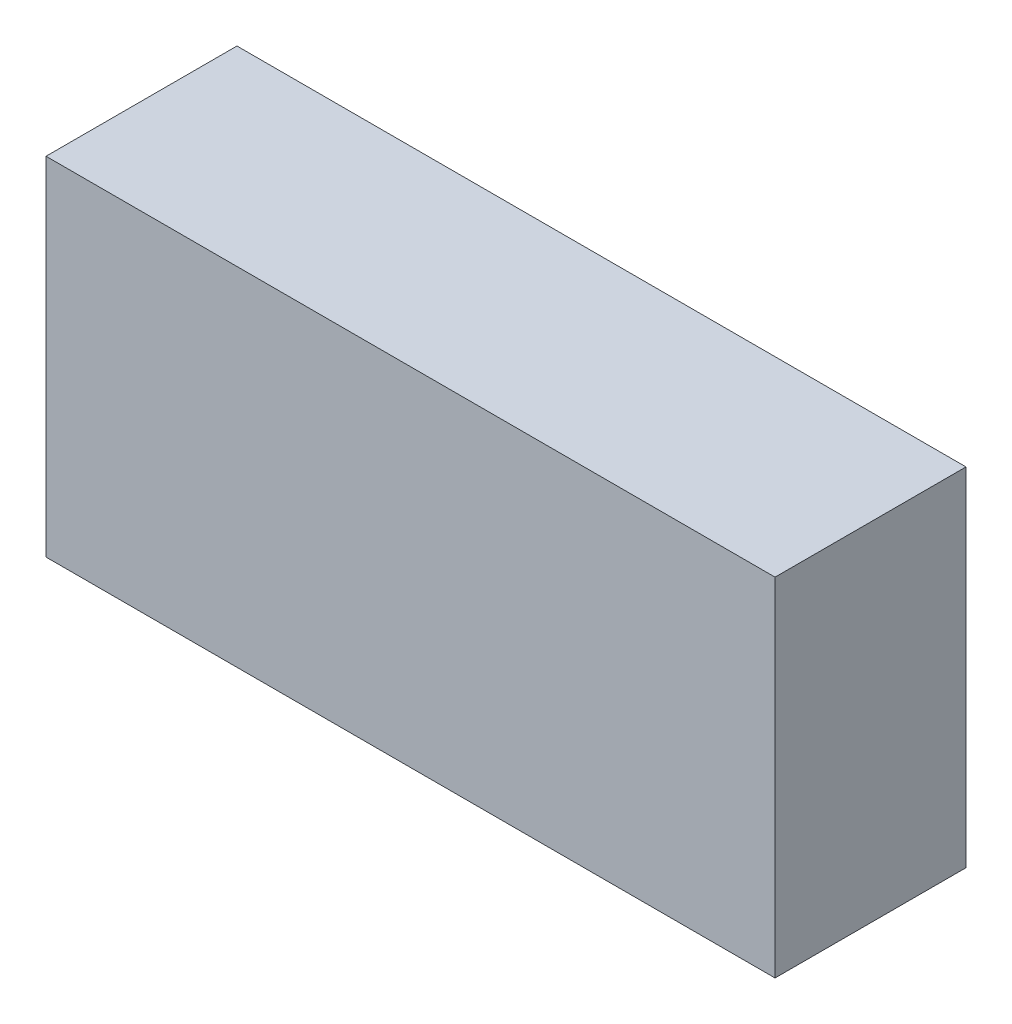
ISO-10303-21;
HEADER;
FILE_DESCRIPTION(('STEP AP214'),'2;1');
FILE_NAME('part.step','',(''),(''),'','','');
FILE_SCHEMA(('AUTOMOTIVE_DESIGN { 1 0 10303 214 1 1 1 1 }'));
ENDSEC;
DATA;
#1=APPLICATION_CONTEXT('core data for automotive mechanical design processes');
#2=APPLICATION_PROTOCOL_DEFINITION('international standard','automotive_design',2000,#1);
#3=PRODUCT_CONTEXT('',#1,'mechanical');
#4=PRODUCT('Part','Part','',(#3));
#5=PRODUCT_RELATED_PRODUCT_CATEGORY('part','',(#4));
#6=PRODUCT_DEFINITION_FORMATION('','',#4);
#7=PRODUCT_DEFINITION_CONTEXT('part definition',#1,'design');
#8=PRODUCT_DEFINITION('design','',#6,#7);
#9=PRODUCT_DEFINITION_SHAPE('','',#8);
#10=(LENGTH_UNIT() NAMED_UNIT(*) SI_UNIT(.MILLI.,.METRE.));
#11=(NAMED_UNIT(*) PLANE_ANGLE_UNIT() SI_UNIT($,.RADIAN.));
#12=(NAMED_UNIT(*) SI_UNIT($,.STERADIAN.) SOLID_ANGLE_UNIT());
#13=UNCERTAINTY_MEASURE_WITH_UNIT(LENGTH_MEASURE(1.E-05),#10,'distance_accuracy_value','');
#14=(GEOMETRIC_REPRESENTATION_CONTEXT(3) GLOBAL_UNCERTAINTY_ASSIGNED_CONTEXT((#13)) GLOBAL_UNIT_ASSIGNED_CONTEXT((#10,
#11,#12)) REPRESENTATION_CONTEXT('',''));
#15=CARTESIAN_POINT('',(0.,0.,0.));
#16=DIRECTION('',(0.,0.,1.));
#17=DIRECTION('',(1.,0.,0.));
#18=AXIS2_PLACEMENT_3D('',#15,#16,#17);
#19=CARTESIAN_POINT('',(-93.04402853943,40.9113931523022,55.));
#20=DIRECTION('',(1.,0.,0.));
#21=DIRECTION('',(0.,1.,0.));
#22=AXIS2_PLACEMENT_3D('',#19,#20,#21);
#23=PLANE('',#22);
#24=DIRECTION('',(0.,-1.,0.));
#25=VECTOR('',#24,1.);
#26=CARTESIAN_POINT('',(-93.04402853943,40.9113931523022,0.));
#27=LINE('',#26,#25);
#28=CARTESIAN_POINT('',(-93.04402853943,40.9113931523022,0.));
#29=VERTEX_POINT('',#28);
#30=CARTESIAN_POINT('',(-93.0440285394299,-59.0886068476978,0.));
#31=VERTEX_POINT('',#30);
#32=EDGE_CURVE('E95',#29,#31,#27,.T.);
#33=ORIENTED_EDGE('',*,*,#32,.T.);
#34=DIRECTION('',(0.,0.,-1.));
#35=VECTOR('',#34,1.);
#36=CARTESIAN_POINT('',(-93.0440285394299,-59.0886068476978,55.));
#37=LINE('',#36,#35);
#38=CARTESIAN_POINT('',(-93.0440285394299,-59.0886068476978,55.));
#39=VERTEX_POINT('',#38);
#40=EDGE_CURVE('E11',#39,#31,#37,.T.);
#41=ORIENTED_EDGE('',*,*,#40,.F.);
#42=DIRECTION('',(0.,-1.,0.));
#43=VECTOR('',#42,1.);
#44=CARTESIAN_POINT('',(-93.04402853943,40.9113931523022,55.));
#45=LINE('',#44,#43);
#46=CARTESIAN_POINT('',(-93.04402853943,40.9113931523022,55.));
#47=VERTEX_POINT('',#46);
#48=EDGE_CURVE('E83',#47,#39,#45,.T.);
#49=ORIENTED_EDGE('',*,*,#48,.F.);
#50=DIRECTION('',(0.,0.,-1.));
#51=VECTOR('',#50,1.);
#52=CARTESIAN_POINT('',(-93.04402853943,40.9113931523022,55.));
#53=LINE('',#52,#51);
#54=EDGE_CURVE('E91',#47,#29,#53,.T.);
#55=ORIENTED_EDGE('',*,*,#54,.T.);
#56=EDGE_LOOP('',(#33,#41,#49,#55));
#57=FACE_BOUND('',#56,.T.);
#58=ADVANCED_FACE('F32',(#57),#23,.F.);
#59=CARTESIAN_POINT('',(-93.0440285394299,-59.0886068476978,55.));
#60=DIRECTION('',(0.,1.,0.));
#61=DIRECTION('',(0.,0.,1.));
#62=AXIS2_PLACEMENT_3D('',#59,#60,#61);
#63=PLANE('',#62);
#64=DIRECTION('',(1.,0.,0.));
#65=VECTOR('',#64,1.);
#66=CARTESIAN_POINT('',(-93.0440285394299,-59.0886068476978,0.));
#67=LINE('',#66,#65);
#68=CARTESIAN_POINT('',(116.95597146057,-59.0886068476978,0.));
#69=VERTEX_POINT('',#68);
#70=EDGE_CURVE('E87',#31,#69,#67,.T.);
#71=ORIENTED_EDGE('',*,*,#70,.T.);
#72=DIRECTION('',(0.,0.,-1.));
#73=VECTOR('',#72,1.);
#74=CARTESIAN_POINT('',(116.95597146057,-59.0886068476978,55.));
#75=LINE('',#74,#73);
#76=CARTESIAN_POINT('',(116.95597146057,-59.0886068476978,55.));
#77=VERTEX_POINT('',#76);
#78=EDGE_CURVE('E40',#77,#69,#75,.T.);
#79=ORIENTED_EDGE('',*,*,#78,.F.);
#80=DIRECTION('',(1.,0.,0.));
#81=VECTOR('',#80,1.);
#82=CARTESIAN_POINT('',(-93.0440285394299,-59.0886068476978,55.));
#83=LINE('',#82,#81);
#84=EDGE_CURVE('E78',#39,#77,#83,.T.);
#85=ORIENTED_EDGE('',*,*,#84,.F.);
#86=ORIENTED_EDGE('',*,*,#40,.T.);
#87=EDGE_LOOP('',(#71,#79,#85,#86));
#88=FACE_BOUND('',#87,.T.);
#89=ADVANCED_FACE('F86',(#88),#63,.F.);
#90=CARTESIAN_POINT('',(116.95597146057,40.9113931523022,55.));
#91=DIRECTION('',(-1.,0.,0.));
#92=DIRECTION('',(0.,0.,1.));
#93=AXIS2_PLACEMENT_3D('',#90,#91,#92);
#94=PLANE('',#93);
#95=DIRECTION('',(0.,1.,0.));
#96=VECTOR('',#95,1.);
#97=CARTESIAN_POINT('',(116.95597146057,40.9113931523022,0.));
#98=LINE('',#97,#96);
#99=CARTESIAN_POINT('',(116.95597146057,40.9113931523022,0.));
#100=VERTEX_POINT('',#99);
#101=EDGE_CURVE('E65',#69,#100,#98,.T.);
#102=ORIENTED_EDGE('',*,*,#101,.T.);
#103=DIRECTION('',(0.,0.,-1.));
#104=VECTOR('',#103,1.);
#105=CARTESIAN_POINT('',(116.95597146057,40.9113931523022,55.));
#106=LINE('',#105,#104);
#107=CARTESIAN_POINT('',(116.95597146057,40.9113931523022,55.));
#108=VERTEX_POINT('',#107);
#109=EDGE_CURVE('E88',#108,#100,#106,.T.);
#110=ORIENTED_EDGE('',*,*,#109,.F.);
#111=DIRECTION('',(0.,1.,0.));
#112=VECTOR('',#111,1.);
#113=CARTESIAN_POINT('',(116.95597146057,40.9113931523022,55.));
#114=LINE('',#113,#112);
#115=EDGE_CURVE('E81',#77,#108,#114,.T.);
#116=ORIENTED_EDGE('',*,*,#115,.F.);
#117=ORIENTED_EDGE('',*,*,#78,.T.);
#118=EDGE_LOOP('',(#102,#110,#116,#117));
#119=FACE_BOUND('',#118,.T.);
#120=ADVANCED_FACE('F89',(#119),#94,.F.);
#121=CARTESIAN_POINT('',(-93.04402853943,40.9113931523022,55.));
#122=DIRECTION('',(0.,-1.,0.));
#123=DIRECTION('',(0.,0.,-1.));
#124=AXIS2_PLACEMENT_3D('',#121,#122,#123);
#125=PLANE('',#124);
#126=DIRECTION('',(-1.,0.,0.));
#127=VECTOR('',#126,1.);
#128=CARTESIAN_POINT('',(-93.04402853943,40.9113931523022,0.));
#129=LINE('',#128,#127);
#130=EDGE_CURVE('E71',#100,#29,#129,.T.);
#131=ORIENTED_EDGE('',*,*,#130,.T.);
#132=ORIENTED_EDGE('',*,*,#54,.F.);
#133=DIRECTION('',(-1.,0.,0.));
#134=VECTOR('',#133,1.);
#135=CARTESIAN_POINT('',(-93.04402853943,40.9113931523022,55.));
#136=LINE('',#135,#134);
#137=EDGE_CURVE('E48',#108,#47,#136,.T.);
#138=ORIENTED_EDGE('',*,*,#137,.F.);
#139=ORIENTED_EDGE('',*,*,#109,.T.);
#140=EDGE_LOOP('',(#131,#132,#138,#139));
#141=FACE_BOUND('',#140,.T.);
#142=ADVANCED_FACE('F102',(#141),#125,.F.);
#143=CARTESIAN_POINT('',(0.,0.,55.));
#144=DIRECTION('',(0.,0.,1.));
#145=DIRECTION('',(1.,0.,0.));
#146=AXIS2_PLACEMENT_3D('',#143,#144,#145);
#147=PLANE('',#146);
#148=ORIENTED_EDGE('',*,*,#48,.T.);
#149=ORIENTED_EDGE('',*,*,#84,.T.);
#150=ORIENTED_EDGE('',*,*,#115,.T.);
#151=ORIENTED_EDGE('',*,*,#137,.T.);
#152=EDGE_LOOP('',(#148,#149,#150,#151));
#153=FACE_BOUND('',#152,.T.);
#154=ADVANCED_FACE('F79',(#153),#147,.T.);
#155=CARTESIAN_POINT('',(0.,0.,0.));
#156=DIRECTION('',(0.,0.,1.));
#157=DIRECTION('',(1.,0.,0.));
#158=AXIS2_PLACEMENT_3D('',#155,#156,#157);
#159=PLANE('',#158);
#160=ORIENTED_EDGE('',*,*,#32,.F.);
#161=ORIENTED_EDGE('',*,*,#130,.F.);
#162=ORIENTED_EDGE('',*,*,#101,.F.);
#163=ORIENTED_EDGE('',*,*,#70,.F.);
#164=EDGE_LOOP('',(#160,#161,#162,#163));
#165=FACE_BOUND('',#164,.T.);
#166=ADVANCED_FACE('F105',(#165),#159,.F.);
#167=CLOSED_SHELL('',(#58,#89,#120,#142,#154,#166));
#168=MANIFOLD_SOLID_BREP('B2',#167);
#169=ADVANCED_BREP_SHAPE_REPRESENTATION('',(#18,#168),#14);
#170=SHAPE_DEFINITION_REPRESENTATION(#9,#169);
ENDSEC;
END-ISO-10303-21;
